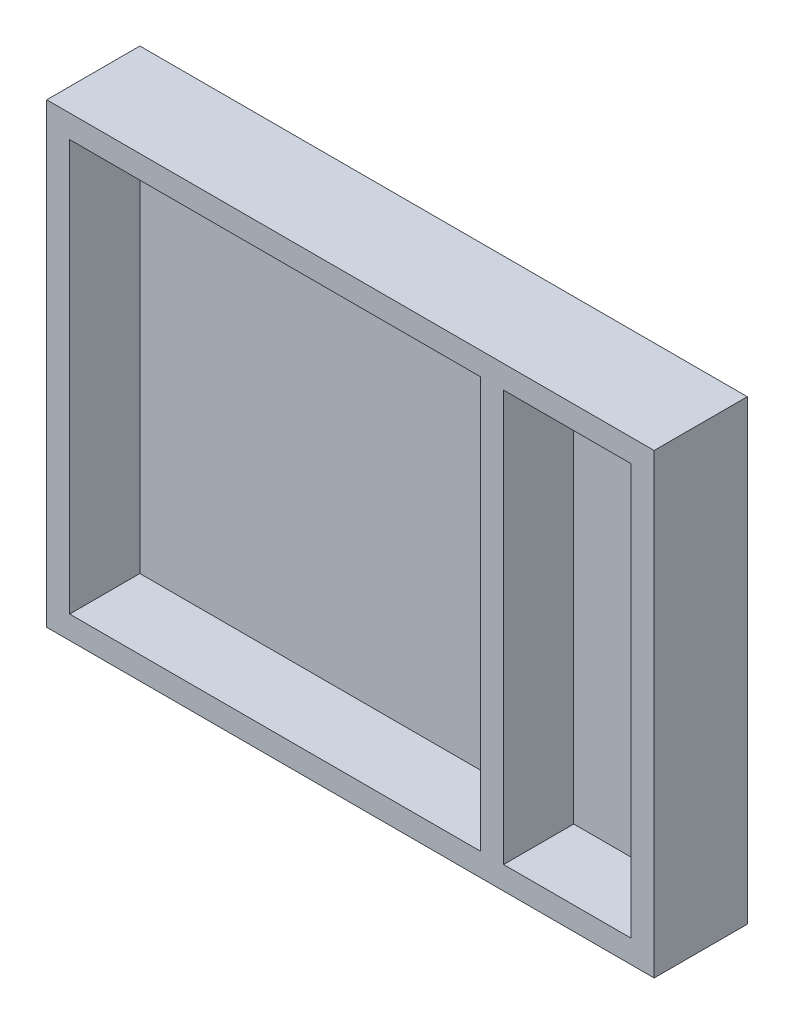
ISO-10303-21;
HEADER;
FILE_DESCRIPTION(('STEP AP214'),'2;1');
FILE_NAME('part.step','',(''),(''),'','','');
FILE_SCHEMA(('AUTOMOTIVE_DESIGN { 1 0 10303 214 1 1 1 1 }'));
ENDSEC;
DATA;
#1=APPLICATION_CONTEXT('core data for automotive mechanical design processes');
#2=APPLICATION_PROTOCOL_DEFINITION('international standard','automotive_design',2000,#1);
#3=PRODUCT_CONTEXT('',#1,'mechanical');
#4=PRODUCT('Part','Part','',(#3));
#5=PRODUCT_RELATED_PRODUCT_CATEGORY('part','',(#4));
#6=PRODUCT_DEFINITION_FORMATION('','',#4);
#7=PRODUCT_DEFINITION_CONTEXT('part definition',#1,'design');
#8=PRODUCT_DEFINITION('design','',#6,#7);
#9=PRODUCT_DEFINITION_SHAPE('','',#8);
#10=(LENGTH_UNIT() NAMED_UNIT(*) SI_UNIT(.MILLI.,.METRE.));
#11=(NAMED_UNIT(*) PLANE_ANGLE_UNIT() SI_UNIT($,.RADIAN.));
#12=(NAMED_UNIT(*) SI_UNIT($,.STERADIAN.) SOLID_ANGLE_UNIT());
#13=UNCERTAINTY_MEASURE_WITH_UNIT(LENGTH_MEASURE(1.E-05),#10,'distance_accuracy_value','');
#14=(GEOMETRIC_REPRESENTATION_CONTEXT(3) GLOBAL_UNCERTAINTY_ASSIGNED_CONTEXT((#13)) GLOBAL_UNIT_ASSIGNED_CONTEXT((#10,
#11,#12)) REPRESENTATION_CONTEXT('',''));
#15=CARTESIAN_POINT('',(0.,0.,0.));
#16=DIRECTION('',(0.,0.,1.));
#17=DIRECTION('',(1.,0.,0.));
#18=AXIS2_PLACEMENT_3D('',#15,#16,#17);
#19=CARTESIAN_POINT('',(0.,-18.,55.));
#20=DIRECTION('',(0.,1.,0.));
#21=DIRECTION('',(0.,0.,1.));
#22=AXIS2_PLACEMENT_3D('',#19,#20,#21);
#23=PLANE('',#22);
#24=DIRECTION('',(0.,0.,-1.));
#25=VECTOR('',#24,1.);
#26=CARTESIAN_POINT('',(-18.,-18.,55.));
#27=LINE('',#26,#25);
#28=CARTESIAN_POINT('',(-18.,-18.,55.));
#29=VERTEX_POINT('',#28);
#30=CARTESIAN_POINT('',(-18.,-18.,-18.));
#31=VERTEX_POINT('',#30);
#32=EDGE_CURVE('E54',#29,#31,#27,.T.);
#33=ORIENTED_EDGE('',*,*,#32,.T.);
#34=DIRECTION('',(-1.,0.,0.));
#35=VECTOR('',#34,1.);
#36=CARTESIAN_POINT('',(458.,-18.,-18.));
#37=LINE('',#36,#35);
#38=CARTESIAN_POINT('',(458.,-18.,-18.));
#39=VERTEX_POINT('',#38);
#40=EDGE_CURVE('E249',#39,#31,#37,.T.);
#41=ORIENTED_EDGE('',*,*,#40,.F.);
#42=DIRECTION('',(0.,0.,-1.));
#43=VECTOR('',#42,1.);
#44=CARTESIAN_POINT('',(458.,-18.,55.));
#45=LINE('',#44,#43);
#46=CARTESIAN_POINT('',(458.,-18.,55.));
#47=VERTEX_POINT('',#46);
#48=EDGE_CURVE('E11',#47,#39,#45,.T.);
#49=ORIENTED_EDGE('',*,*,#48,.F.);
#50=DIRECTION('',(1.,0.,0.));
#51=VECTOR('',#50,1.);
#52=CARTESIAN_POINT('',(0.,-18.,55.));
#53=LINE('',#52,#51);
#54=EDGE_CURVE('E130',#29,#47,#53,.T.);
#55=ORIENTED_EDGE('',*,*,#54,.F.);
#56=EDGE_LOOP('',(#33,#41,#49,#55));
#57=FACE_BOUND('',#56,.T.);
#58=ADVANCED_FACE('F35',(#57),#23,.F.);
#59=CARTESIAN_POINT('',(458.,0.,55.));
#60=DIRECTION('',(1.,0.,0.));
#61=DIRECTION('',(0.,0.,-1.));
#62=AXIS2_PLACEMENT_3D('',#59,#60,#61);
#63=PLANE('',#62);
#64=ORIENTED_EDGE('',*,*,#48,.T.);
#65=DIRECTION('',(0.,-1.,0.));
#66=VECTOR('',#65,1.);
#67=CARTESIAN_POINT('',(458.,340.,-18.));
#68=LINE('',#67,#66);
#69=CARTESIAN_POINT('',(458.,340.,-18.));
#70=VERTEX_POINT('',#69);
#71=EDGE_CURVE('E118',#70,#39,#68,.T.);
#72=ORIENTED_EDGE('',*,*,#71,.F.);
#73=DIRECTION('',(0.,0.,-1.));
#74=VECTOR('',#73,1.);
#75=CARTESIAN_POINT('',(458.,340.,55.));
#76=LINE('',#75,#74);
#77=CARTESIAN_POINT('',(458.,340.,55.));
#78=VERTEX_POINT('',#77);
#79=EDGE_CURVE('E45',#78,#70,#76,.T.);
#80=ORIENTED_EDGE('',*,*,#79,.F.);
#81=DIRECTION('',(0.,-1.,0.));
#82=VECTOR('',#81,1.);
#83=CARTESIAN_POINT('',(458.,0.,55.));
#84=LINE('',#83,#82);
#85=EDGE_CURVE('E115',#78,#47,#84,.T.);
#86=ORIENTED_EDGE('',*,*,#85,.T.);
#87=EDGE_LOOP('',(#64,#72,#80,#86));
#88=FACE_BOUND('',#87,.T.);
#89=ADVANCED_FACE('F114',(#88),#63,.T.);
#90=CARTESIAN_POINT('',(0.,340.,55.));
#91=DIRECTION('',(0.,1.,0.));
#92=DIRECTION('',(0.,0.,1.));
#93=AXIS2_PLACEMENT_3D('',#90,#91,#92);
#94=PLANE('',#93);
#95=ORIENTED_EDGE('',*,*,#79,.T.);
#96=DIRECTION('',(1.,0.,0.));
#97=VECTOR('',#96,1.);
#98=CARTESIAN_POINT('',(458.,340.,-18.));
#99=LINE('',#98,#97);
#100=CARTESIAN_POINT('',(-18.,340.,-18.));
#101=VERTEX_POINT('',#100);
#102=EDGE_CURVE('E143',#101,#70,#99,.T.);
#103=ORIENTED_EDGE('',*,*,#102,.F.);
#104=DIRECTION('',(0.,0.,-1.));
#105=VECTOR('',#104,1.);
#106=CARTESIAN_POINT('',(-18.,340.,55.));
#107=LINE('',#106,#105);
#108=CARTESIAN_POINT('',(-18.,340.,55.));
#109=VERTEX_POINT('',#108);
#110=EDGE_CURVE('E123',#109,#101,#107,.T.);
#111=ORIENTED_EDGE('',*,*,#110,.F.);
#112=DIRECTION('',(1.,0.,0.));
#113=VECTOR('',#112,1.);
#114=CARTESIAN_POINT('',(0.,340.,55.));
#115=LINE('',#114,#113);
#116=EDGE_CURVE('E129',#109,#78,#115,.T.);
#117=ORIENTED_EDGE('',*,*,#116,.T.);
#118=EDGE_LOOP('',(#95,#103,#111,#117));
#119=FACE_BOUND('',#118,.T.);
#120=ADVANCED_FACE('F133',(#119),#94,.T.);
#121=CARTESIAN_POINT('',(322.,0.,55.));
#122=DIRECTION('',(-1.,0.,0.));
#123=DIRECTION('',(0.,0.,1.));
#124=AXIS2_PLACEMENT_3D('',#121,#122,#123);
#125=PLANE('',#124);
#126=DIRECTION('',(0.,1.,0.));
#127=VECTOR('',#126,1.);
#128=CARTESIAN_POINT('',(322.,0.,0.));
#129=LINE('',#128,#127);
#130=CARTESIAN_POINT('',(322.,0.,0.));
#131=VERTEX_POINT('',#130);
#132=CARTESIAN_POINT('',(322.,322.,0.));
#133=VERTEX_POINT('',#132);
#134=EDGE_CURVE('E151',#131,#133,#129,.T.);
#135=ORIENTED_EDGE('',*,*,#134,.F.);
#136=DIRECTION('',(0.,0.,-1.));
#137=VECTOR('',#136,1.);
#138=CARTESIAN_POINT('',(322.,0.,55.));
#139=LINE('',#138,#137);
#140=CARTESIAN_POINT('',(322.,0.,55.));
#141=VERTEX_POINT('',#140);
#142=EDGE_CURVE('E162',#141,#131,#139,.T.);
#143=ORIENTED_EDGE('',*,*,#142,.F.);
#144=DIRECTION('',(0.,1.,0.));
#145=VECTOR('',#144,1.);
#146=CARTESIAN_POINT('',(322.,0.,55.));
#147=LINE('',#146,#145);
#148=CARTESIAN_POINT('',(322.,322.,55.));
#149=VERTEX_POINT('',#148);
#150=EDGE_CURVE('E208',#141,#149,#147,.T.);
#151=ORIENTED_EDGE('',*,*,#150,.T.);
#152=DIRECTION('',(0.,0.,-1.));
#153=VECTOR('',#152,1.);
#154=CARTESIAN_POINT('',(322.,322.,55.));
#155=LINE('',#154,#153);
#156=EDGE_CURVE('E164',#149,#133,#155,.T.);
#157=ORIENTED_EDGE('',*,*,#156,.T.);
#158=EDGE_LOOP('',(#135,#143,#151,#157));
#159=FACE_BOUND('',#158,.T.);
#160=ADVANCED_FACE('F233',(#159),#125,.T.);
#161=CARTESIAN_POINT('',(0.,0.,55.));
#162=DIRECTION('',(0.,1.,0.));
#163=DIRECTION('',(0.,0.,1.));
#164=AXIS2_PLACEMENT_3D('',#161,#162,#163);
#165=PLANE('',#164);
#166=DIRECTION('',(1.,0.,0.));
#167=VECTOR('',#166,1.);
#168=CARTESIAN_POINT('',(0.,0.,0.));
#169=LINE('',#168,#167);
#170=CARTESIAN_POINT('',(0.,0.,0.));
#171=VERTEX_POINT('',#170);
#172=EDGE_CURVE('E77',#171,#131,#169,.T.);
#173=ORIENTED_EDGE('',*,*,#172,.F.);
#174=DIRECTION('',(0.,0.,-1.));
#175=VECTOR('',#174,1.);
#176=CARTESIAN_POINT('',(0.,0.,55.));
#177=LINE('',#176,#175);
#178=CARTESIAN_POINT('',(0.,0.,55.));
#179=VERTEX_POINT('',#178);
#180=EDGE_CURVE('E170',#179,#171,#177,.T.);
#181=ORIENTED_EDGE('',*,*,#180,.F.);
#182=DIRECTION('',(1.,0.,0.));
#183=VECTOR('',#182,1.);
#184=CARTESIAN_POINT('',(0.,0.,55.));
#185=LINE('',#184,#183);
#186=EDGE_CURVE('E215',#179,#141,#185,.T.);
#187=ORIENTED_EDGE('',*,*,#186,.T.);
#188=ORIENTED_EDGE('',*,*,#142,.T.);
#189=EDGE_LOOP('',(#173,#181,#187,#188));
#190=FACE_BOUND('',#189,.T.);
#191=ADVANCED_FACE('F235',(#190),#165,.T.);
#192=CARTESIAN_POINT('',(0.,0.,55.));
#193=DIRECTION('',(-1.,0.,0.));
#194=DIRECTION('',(0.,0.,1.));
#195=AXIS2_PLACEMENT_3D('',#192,#193,#194);
#196=PLANE('',#195);
#197=DIRECTION('',(0.,1.,0.));
#198=VECTOR('',#197,1.);
#199=CARTESIAN_POINT('',(0.,0.,0.));
#200=LINE('',#199,#198);
#201=CARTESIAN_POINT('',(0.,322.,0.));
#202=VERTEX_POINT('',#201);
#203=EDGE_CURVE('E154',#171,#202,#200,.T.);
#204=ORIENTED_EDGE('',*,*,#203,.T.);
#205=DIRECTION('',(0.,0.,-1.));
#206=VECTOR('',#205,1.);
#207=CARTESIAN_POINT('',(0.,322.,55.));
#208=LINE('',#207,#206);
#209=CARTESIAN_POINT('',(0.,322.,55.));
#210=VERTEX_POINT('',#209);
#211=EDGE_CURVE('E167',#210,#202,#208,.T.);
#212=ORIENTED_EDGE('',*,*,#211,.F.);
#213=DIRECTION('',(0.,1.,0.));
#214=VECTOR('',#213,1.);
#215=CARTESIAN_POINT('',(0.,0.,55.));
#216=LINE('',#215,#214);
#217=EDGE_CURVE('E218',#179,#210,#216,.T.);
#218=ORIENTED_EDGE('',*,*,#217,.F.);
#219=ORIENTED_EDGE('',*,*,#180,.T.);
#220=EDGE_LOOP('',(#204,#212,#218,#219));
#221=FACE_BOUND('',#220,.T.);
#222=ADVANCED_FACE('F237',(#221),#196,.F.);
#223=CARTESIAN_POINT('',(0.,0.,55.));
#224=DIRECTION('',(0.,-1.,0.));
#225=DIRECTION('',(1.,0.,0.));
#226=AXIS2_PLACEMENT_3D('',#223,#224,#225);
#227=PLANE('',#226);
#228=DIRECTION('',(-1.,0.,0.));
#229=VECTOR('',#228,1.);
#230=CARTESIAN_POINT('',(0.,0.,0.));
#231=LINE('',#230,#229);
#232=CARTESIAN_POINT('',(440.,0.,0.));
#233=VERTEX_POINT('',#232);
#234=CARTESIAN_POINT('',(340.,0.,0.));
#235=VERTEX_POINT('',#234);
#236=EDGE_CURVE('E67',#233,#235,#231,.T.);
#237=ORIENTED_EDGE('',*,*,#236,.T.);
#238=DIRECTION('',(0.,0.,-1.));
#239=VECTOR('',#238,1.);
#240=CARTESIAN_POINT('',(340.,0.,55.));
#241=LINE('',#240,#239);
#242=CARTESIAN_POINT('',(340.,0.,55.));
#243=VERTEX_POINT('',#242);
#244=EDGE_CURVE('E39',#243,#235,#241,.T.);
#245=ORIENTED_EDGE('',*,*,#244,.F.);
#246=DIRECTION('',(-1.,0.,0.));
#247=VECTOR('',#246,1.);
#248=CARTESIAN_POINT('',(0.,0.,55.));
#249=LINE('',#248,#247);
#250=CARTESIAN_POINT('',(440.,0.,55.));
#251=VERTEX_POINT('',#250);
#252=EDGE_CURVE('E160',#251,#243,#249,.T.);
#253=ORIENTED_EDGE('',*,*,#252,.F.);
#254=DIRECTION('',(0.,0.,-1.));
#255=VECTOR('',#254,1.);
#256=CARTESIAN_POINT('',(440.,0.,55.));
#257=LINE('',#256,#255);
#258=EDGE_CURVE('E137',#251,#233,#257,.T.);
#259=ORIENTED_EDGE('',*,*,#258,.T.);
#260=EDGE_LOOP('',(#237,#245,#253,#259));
#261=FACE_BOUND('',#260,.T.);
#262=ADVANCED_FACE('F37',(#261),#227,.F.);
#263=CARTESIAN_POINT('',(340.,0.,55.));
#264=DIRECTION('',(-1.,0.,0.));
#265=DIRECTION('',(0.,0.,1.));
#266=AXIS2_PLACEMENT_3D('',#263,#264,#265);
#267=PLANE('',#266);
#268=DIRECTION('',(0.,1.,0.));
#269=VECTOR('',#268,1.);
#270=CARTESIAN_POINT('',(340.,0.,0.));
#271=LINE('',#270,#269);
#272=CARTESIAN_POINT('',(340.,322.,0.));
#273=VERTEX_POINT('',#272);
#274=EDGE_CURVE('E142',#235,#273,#271,.T.);
#275=ORIENTED_EDGE('',*,*,#274,.T.);
#276=DIRECTION('',(0.,0.,-1.));
#277=VECTOR('',#276,1.);
#278=CARTESIAN_POINT('',(340.,322.,55.));
#279=LINE('',#278,#277);
#280=CARTESIAN_POINT('',(340.,322.,55.));
#281=VERTEX_POINT('',#280);
#282=EDGE_CURVE('E178',#281,#273,#279,.T.);
#283=ORIENTED_EDGE('',*,*,#282,.F.);
#284=DIRECTION('',(0.,1.,0.));
#285=VECTOR('',#284,1.);
#286=CARTESIAN_POINT('',(340.,0.,55.));
#287=LINE('',#286,#285);
#288=EDGE_CURVE('E189',#243,#281,#287,.T.);
#289=ORIENTED_EDGE('',*,*,#288,.F.);
#290=ORIENTED_EDGE('',*,*,#244,.T.);
#291=EDGE_LOOP('',(#275,#283,#289,#290));
#292=FACE_BOUND('',#291,.T.);
#293=ADVANCED_FACE('F188',(#292),#267,.F.);
#294=CARTESIAN_POINT('',(-1.7874590696465E-13,322.,55.));
#295=DIRECTION('',(0.,1.,0.));
#296=DIRECTION('',(-1.,0.,0.));
#297=AXIS2_PLACEMENT_3D('',#294,#295,#296);
#298=PLANE('',#297);
#299=DIRECTION('',(1.,0.,0.));
#300=VECTOR('',#299,1.);
#301=CARTESIAN_POINT('',(-1.7874590696465E-13,322.,0.));
#302=LINE('',#301,#300);
#303=CARTESIAN_POINT('',(440.,322.,0.));
#304=VERTEX_POINT('',#303);
#305=EDGE_CURVE('E146',#273,#304,#302,.T.);
#306=ORIENTED_EDGE('',*,*,#305,.T.);
#307=DIRECTION('',(0.,0.,-1.));
#308=VECTOR('',#307,1.);
#309=CARTESIAN_POINT('',(440.,322.,55.));
#310=LINE('',#309,#308);
#311=CARTESIAN_POINT('',(440.,322.,55.));
#312=VERTEX_POINT('',#311);
#313=EDGE_CURVE('E176',#312,#304,#310,.T.);
#314=ORIENTED_EDGE('',*,*,#313,.F.);
#315=DIRECTION('',(1.,0.,0.));
#316=VECTOR('',#315,1.);
#317=CARTESIAN_POINT('',(-1.7874590696465E-13,322.,55.));
#318=LINE('',#317,#316);
#319=EDGE_CURVE('E205',#281,#312,#318,.T.);
#320=ORIENTED_EDGE('',*,*,#319,.F.);
#321=ORIENTED_EDGE('',*,*,#282,.T.);
#322=EDGE_LOOP('',(#306,#314,#320,#321));
#323=FACE_BOUND('',#322,.T.);
#324=ADVANCED_FACE('F204',(#323),#298,.F.);
#325=CARTESIAN_POINT('',(0.,322.,55.));
#326=DIRECTION('',(0.,1.,0.));
#327=DIRECTION('',(0.,0.,1.));
#328=AXIS2_PLACEMENT_3D('',#325,#326,#327);
#329=PLANE('',#328);
#330=DIRECTION('',(1.,0.,0.));
#331=VECTOR('',#330,1.);
#332=CARTESIAN_POINT('',(0.,322.,0.));
#333=LINE('',#332,#331);
#334=EDGE_CURVE('E157',#202,#133,#333,.T.);
#335=ORIENTED_EDGE('',*,*,#334,.T.);
#336=ORIENTED_EDGE('',*,*,#156,.F.);
#337=DIRECTION('',(1.,0.,0.));
#338=VECTOR('',#337,1.);
#339=CARTESIAN_POINT('',(0.,322.,55.));
#340=LINE('',#339,#338);
#341=EDGE_CURVE('E221',#210,#149,#340,.T.);
#342=ORIENTED_EDGE('',*,*,#341,.F.);
#343=ORIENTED_EDGE('',*,*,#211,.T.);
#344=EDGE_LOOP('',(#335,#336,#342,#343));
#345=FACE_BOUND('',#344,.T.);
#346=ADVANCED_FACE('F229',(#345),#329,.F.);
#347=CARTESIAN_POINT('',(440.,0.,55.));
#348=DIRECTION('',(1.,0.,0.));
#349=DIRECTION('',(0.,1.,0.));
#350=AXIS2_PLACEMENT_3D('',#347,#348,#349);
#351=PLANE('',#350);
#352=DIRECTION('',(0.,-1.,0.));
#353=VECTOR('',#352,1.);
#354=CARTESIAN_POINT('',(440.,0.,0.));
#355=LINE('',#354,#353);
#356=EDGE_CURVE('E149',#304,#233,#355,.T.);
#357=ORIENTED_EDGE('',*,*,#356,.T.);
#358=ORIENTED_EDGE('',*,*,#258,.F.);
#359=DIRECTION('',(0.,-1.,0.));
#360=VECTOR('',#359,1.);
#361=CARTESIAN_POINT('',(440.,0.,55.));
#362=LINE('',#361,#360);
#363=EDGE_CURVE('E198',#312,#251,#362,.T.);
#364=ORIENTED_EDGE('',*,*,#363,.F.);
#365=ORIENTED_EDGE('',*,*,#313,.T.);
#366=EDGE_LOOP('',(#357,#358,#364,#365));
#367=FACE_BOUND('',#366,.T.);
#368=ADVANCED_FACE('F197',(#367),#351,.F.);
#369=CARTESIAN_POINT('',(-18.,0.,55.));
#370=DIRECTION('',(-1.,0.,0.));
#371=DIRECTION('',(0.,0.,1.));
#372=AXIS2_PLACEMENT_3D('',#369,#370,#371);
#373=PLANE('',#372);
#374=ORIENTED_EDGE('',*,*,#110,.T.);
#375=DIRECTION('',(0.,1.,0.));
#376=VECTOR('',#375,1.);
#377=CARTESIAN_POINT('',(-18.,340.,-18.));
#378=LINE('',#377,#376);
#379=EDGE_CURVE('E252',#31,#101,#378,.T.);
#380=ORIENTED_EDGE('',*,*,#379,.F.);
#381=ORIENTED_EDGE('',*,*,#32,.F.);
#382=DIRECTION('',(0.,1.,0.));
#383=VECTOR('',#382,1.);
#384=CARTESIAN_POINT('',(-18.,0.,55.));
#385=LINE('',#384,#383);
#386=EDGE_CURVE('E135',#29,#109,#385,.T.);
#387=ORIENTED_EDGE('',*,*,#386,.T.);
#388=EDGE_LOOP('',(#374,#380,#381,#387));
#389=FACE_BOUND('',#388,.T.);
#390=ADVANCED_FACE('F259',(#389),#373,.T.);
#391=CARTESIAN_POINT('',(0.,0.,55.));
#392=DIRECTION('',(0.,0.,1.));
#393=DIRECTION('',(1.,0.,0.));
#394=AXIS2_PLACEMENT_3D('',#391,#392,#393);
#395=PLANE('',#394);
#396=ORIENTED_EDGE('',*,*,#252,.T.);
#397=ORIENTED_EDGE('',*,*,#288,.T.);
#398=ORIENTED_EDGE('',*,*,#319,.T.);
#399=ORIENTED_EDGE('',*,*,#363,.T.);
#400=EDGE_LOOP('',(#396,#397,#398,#399));
#401=FACE_BOUND('',#400,.T.);
#402=ORIENTED_EDGE('',*,*,#150,.F.);
#403=ORIENTED_EDGE('',*,*,#186,.F.);
#404=ORIENTED_EDGE('',*,*,#217,.T.);
#405=ORIENTED_EDGE('',*,*,#341,.T.);
#406=EDGE_LOOP('',(#402,#403,#404,#405));
#407=FACE_BOUND('',#406,.T.);
#408=ORIENTED_EDGE('',*,*,#54,.T.);
#409=ORIENTED_EDGE('',*,*,#85,.F.);
#410=ORIENTED_EDGE('',*,*,#116,.F.);
#411=ORIENTED_EDGE('',*,*,#386,.F.);
#412=EDGE_LOOP('',(#408,#409,#410,#411));
#413=FACE_BOUND('',#412,.T.);
#414=ADVANCED_FACE('F127',(#401,#407,#413),#395,.T.);
#415=CARTESIAN_POINT('',(0.,0.,-18.));
#416=DIRECTION('',(0.,0.,-1.));
#417=DIRECTION('',(-1.,0.,0.));
#418=AXIS2_PLACEMENT_3D('',#415,#416,#417);
#419=PLANE('',#418);
#420=ORIENTED_EDGE('',*,*,#71,.T.);
#421=ORIENTED_EDGE('',*,*,#40,.T.);
#422=ORIENTED_EDGE('',*,*,#379,.T.);
#423=ORIENTED_EDGE('',*,*,#102,.T.);
#424=EDGE_LOOP('',(#420,#421,#422,#423));
#425=FACE_BOUND('',#424,.T.);
#426=ADVANCED_FACE('F254',(#425),#419,.T.);
#427=CARTESIAN_POINT('',(0.,0.,0.));
#428=DIRECTION('',(0.,0.,-1.));
#429=DIRECTION('',(-1.,0.,0.));
#430=AXIS2_PLACEMENT_3D('',#427,#428,#429);
#431=PLANE('',#430);
#432=ORIENTED_EDGE('',*,*,#274,.F.);
#433=ORIENTED_EDGE('',*,*,#236,.F.);
#434=ORIENTED_EDGE('',*,*,#356,.F.);
#435=ORIENTED_EDGE('',*,*,#305,.F.);
#436=EDGE_LOOP('',(#432,#433,#434,#435));
#437=FACE_BOUND('',#436,.T.);
#438=ADVANCED_FACE('F202',(#437),#431,.F.);
#439=ORIENTED_EDGE('',*,*,#134,.T.);
#440=ORIENTED_EDGE('',*,*,#334,.F.);
#441=ORIENTED_EDGE('',*,*,#203,.F.);
#442=ORIENTED_EDGE('',*,*,#172,.T.);
#443=EDGE_LOOP('',(#439,#440,#441,#442));
#444=FACE_BOUND('',#443,.T.);
#445=ADVANCED_FACE('F399',(#444),#431,.F.);
#446=CLOSED_SHELL('',(#58,#89,#120,#160,#191,#222,#262,#293,#324,#346,#368,#390,#414,#426,#438,#445));
#447=MANIFOLD_SOLID_BREP('B2',#446);
#448=ADVANCED_BREP_SHAPE_REPRESENTATION('',(#18,#447),#14);
#449=SHAPE_DEFINITION_REPRESENTATION(#9,#448);
ENDSEC;
END-ISO-10303-21;
